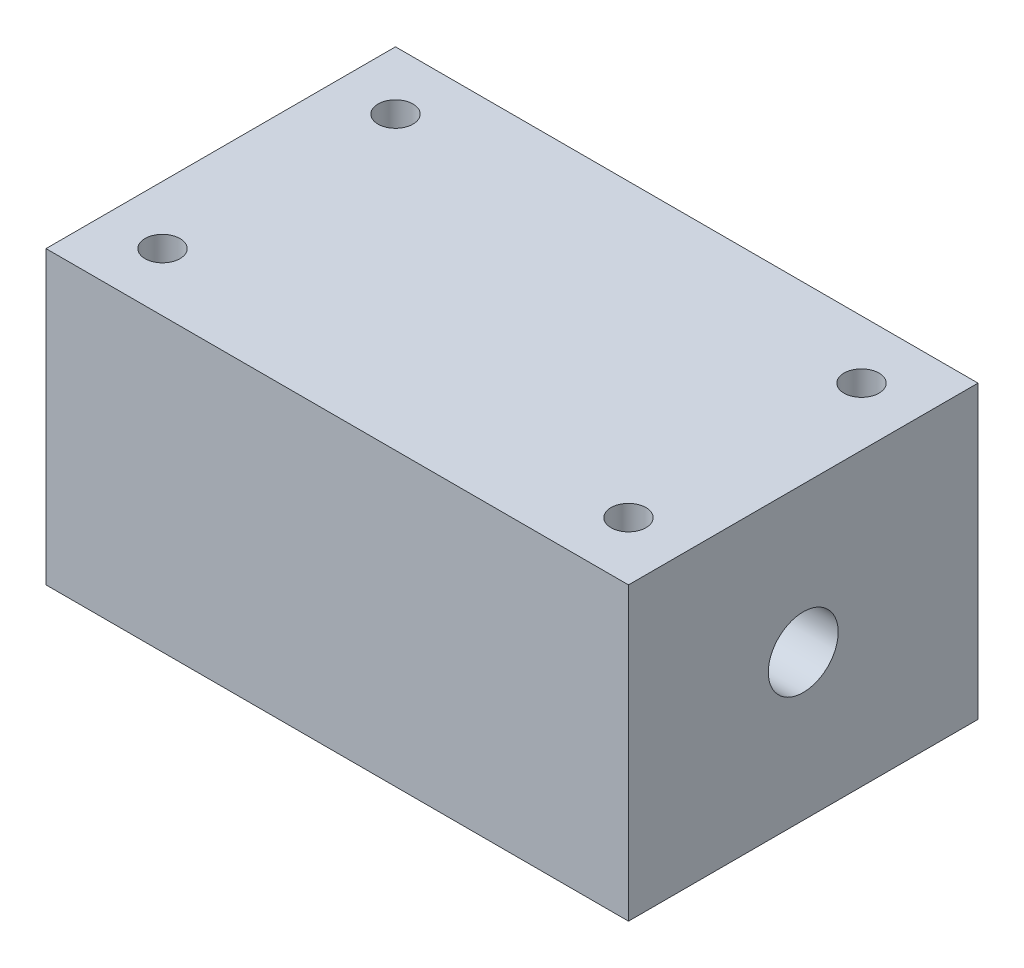
ISO-10303-21;
HEADER;
FILE_DESCRIPTION(('STEP AP214'),'2;1');
FILE_NAME('part.step','',(''),(''),'','','');
FILE_SCHEMA(('AUTOMOTIVE_DESIGN { 1 0 10303 214 1 1 1 1 }'));
ENDSEC;
DATA;
#1=APPLICATION_CONTEXT('core data for automotive mechanical design processes');
#2=APPLICATION_PROTOCOL_DEFINITION('international standard','automotive_design',2000,#1);
#3=PRODUCT_CONTEXT('',#1,'mechanical');
#4=PRODUCT('Part','Part','',(#3));
#5=PRODUCT_RELATED_PRODUCT_CATEGORY('part','',(#4));
#6=PRODUCT_DEFINITION_FORMATION('','',#4);
#7=PRODUCT_DEFINITION_CONTEXT('part definition',#1,'design');
#8=PRODUCT_DEFINITION('design','',#6,#7);
#9=PRODUCT_DEFINITION_SHAPE('','',#8);
#10=(LENGTH_UNIT() NAMED_UNIT(*) SI_UNIT(.MILLI.,.METRE.));
#11=(NAMED_UNIT(*) PLANE_ANGLE_UNIT() SI_UNIT($,.RADIAN.));
#12=(NAMED_UNIT(*) SI_UNIT($,.STERADIAN.) SOLID_ANGLE_UNIT());
#13=UNCERTAINTY_MEASURE_WITH_UNIT(LENGTH_MEASURE(1.E-05),#10,'distance_accuracy_value','');
#14=(GEOMETRIC_REPRESENTATION_CONTEXT(3) GLOBAL_UNCERTAINTY_ASSIGNED_CONTEXT((#13)) GLOBAL_UNIT_ASSIGNED_CONTEXT((#10,
#11,#12)) REPRESENTATION_CONTEXT('',''));
#15=CARTESIAN_POINT('',(0.,0.,0.));
#16=DIRECTION('',(0.,0.,1.));
#17=DIRECTION('',(1.,0.,0.));
#18=AXIS2_PLACEMENT_3D('',#15,#16,#17);
#19=CARTESIAN_POINT('',(25.,25.,-15.));
#20=DIRECTION('',(0.,-1.,0.));
#21=DIRECTION('',(0.,0.,-1.));
#22=AXIS2_PLACEMENT_3D('',#19,#20,#21);
#23=PLANE('',#22);
#24=CARTESIAN_POINT('',(20.,25.,9.99999999999997));
#25=DIRECTION('',(0.,1.,0.));
#26=DIRECTION('',(0.,0.,1.));
#27=AXIS2_PLACEMENT_3D('',#24,#25,#26);
#28=CIRCLE('',#27,1.5);
#29=CARTESIAN_POINT('',(20.,25.,11.5));
#30=VERTEX_POINT('',#29);
#31=EDGE_CURVE('E118',#30,#30,#28,.T.);
#32=ORIENTED_EDGE('',*,*,#31,.F.);
#33=EDGE_LOOP('',(#32));
#34=FACE_BOUND('',#33,.T.);
#35=CARTESIAN_POINT('',(-20.,25.,-9.99999999999999));
#36=DIRECTION('',(0.,1.,0.));
#37=DIRECTION('',(0.,0.,1.));
#38=AXIS2_PLACEMENT_3D('',#35,#36,#37);
#39=CIRCLE('',#38,1.5);
#40=CARTESIAN_POINT('',(-20.,25.,-8.49999999999999));
#41=VERTEX_POINT('',#40);
#42=EDGE_CURVE('E97',#41,#41,#39,.T.);
#43=ORIENTED_EDGE('',*,*,#42,.F.);
#44=EDGE_LOOP('',(#43));
#45=FACE_BOUND('',#44,.T.);
#46=DIRECTION('',(0.,0.,-1.));
#47=VECTOR('',#46,1.);
#48=CARTESIAN_POINT('',(25.,25.,15.));
#49=LINE('',#48,#47);
#50=CARTESIAN_POINT('',(25.,25.,15.));
#51=VERTEX_POINT('',#50);
#52=CARTESIAN_POINT('',(25.,25.,-15.));
#53=VERTEX_POINT('',#52);
#54=EDGE_CURVE('E82',#51,#53,#49,.T.);
#55=ORIENTED_EDGE('',*,*,#54,.T.);
#56=DIRECTION('',(-1.,0.,0.));
#57=VECTOR('',#56,1.);
#58=CARTESIAN_POINT('',(-25.,25.,-15.));
#59=LINE('',#58,#57);
#60=CARTESIAN_POINT('',(-25.,25.,-15.));
#61=VERTEX_POINT('',#60);
#62=EDGE_CURVE('E77',#53,#61,#59,.T.);
#63=ORIENTED_EDGE('',*,*,#62,.T.);
#64=DIRECTION('',(0.,0.,1.));
#65=VECTOR('',#64,1.);
#66=CARTESIAN_POINT('',(-25.,25.,15.));
#67=LINE('',#66,#65);
#68=CARTESIAN_POINT('',(-25.,25.,15.));
#69=VERTEX_POINT('',#68);
#70=EDGE_CURVE('E80',#61,#69,#67,.T.);
#71=ORIENTED_EDGE('',*,*,#70,.T.);
#72=DIRECTION('',(1.,0.,0.));
#73=VECTOR('',#72,1.);
#74=CARTESIAN_POINT('',(-25.,25.,15.));
#75=LINE('',#74,#73);
#76=EDGE_CURVE('E47',#69,#51,#75,.T.);
#77=ORIENTED_EDGE('',*,*,#76,.T.);
#78=EDGE_LOOP('',(#55,#63,#71,#77));
#79=FACE_BOUND('',#78,.T.);
#80=CARTESIAN_POINT('',(-20.,25.,9.99999999999997));
#81=DIRECTION('',(0.,1.,0.));
#82=DIRECTION('',(0.,0.,-1.));
#83=AXIS2_PLACEMENT_3D('',#80,#81,#82);
#84=CIRCLE('',#83,1.5);
#85=CARTESIAN_POINT('',(-20.,25.,8.49999999999997));
#86=VERTEX_POINT('',#85);
#87=EDGE_CURVE('E112',#86,#86,#84,.T.);
#88=ORIENTED_EDGE('',*,*,#87,.F.);
#89=EDGE_LOOP('',(#88));
#90=FACE_BOUND('',#89,.T.);
#91=CARTESIAN_POINT('',(20.,25.,-10.));
#92=DIRECTION('',(0.,1.,0.));
#93=DIRECTION('',(0.,0.,-1.));
#94=AXIS2_PLACEMENT_3D('',#91,#92,#93);
#95=CIRCLE('',#94,1.5);
#96=CARTESIAN_POINT('',(20.,25.,-11.5));
#97=VERTEX_POINT('',#96);
#98=EDGE_CURVE('E124',#97,#97,#95,.T.);
#99=ORIENTED_EDGE('',*,*,#98,.F.);
#100=EDGE_LOOP('',(#99));
#101=FACE_BOUND('',#100,.T.);
#102=ADVANCED_FACE('F30',(#34,#45,#79,#90,#101),#23,.F.);
#103=CARTESIAN_POINT('',(25.,0.,-15.));
#104=DIRECTION('',(0.,-1.,0.));
#105=DIRECTION('',(0.,0.,-1.));
#106=AXIS2_PLACEMENT_3D('',#103,#104,#105);
#107=PLANE('',#106);
#108=CARTESIAN_POINT('',(20.,0.,9.99999999999997));
#109=DIRECTION('',(0.,1.,0.));
#110=DIRECTION('',(0.,0.,1.));
#111=AXIS2_PLACEMENT_3D('',#108,#109,#110);
#112=CIRCLE('',#111,1.5);
#113=CARTESIAN_POINT('',(20.,0.,11.5));
#114=VERTEX_POINT('',#113);
#115=EDGE_CURVE('E121',#114,#114,#112,.T.);
#116=ORIENTED_EDGE('',*,*,#115,.T.);
#117=EDGE_LOOP('',(#116));
#118=FACE_BOUND('',#117,.T.);
#119=CARTESIAN_POINT('',(-20.,0.,-9.99999999999999));
#120=DIRECTION('',(0.,1.,0.));
#121=DIRECTION('',(0.,0.,1.));
#122=AXIS2_PLACEMENT_3D('',#119,#120,#121);
#123=CIRCLE('',#122,1.5);
#124=CARTESIAN_POINT('',(-20.,0.,-8.49999999999999));
#125=VERTEX_POINT('',#124);
#126=EDGE_CURVE('E109',#125,#125,#123,.T.);
#127=ORIENTED_EDGE('',*,*,#126,.T.);
#128=EDGE_LOOP('',(#127));
#129=FACE_BOUND('',#128,.T.);
#130=DIRECTION('',(0.,0.,-1.));
#131=VECTOR('',#130,1.);
#132=CARTESIAN_POINT('',(25.,0.,15.));
#133=LINE('',#132,#131);
#134=CARTESIAN_POINT('',(25.,0.,15.));
#135=VERTEX_POINT('',#134);
#136=CARTESIAN_POINT('',(25.,0.,-15.));
#137=VERTEX_POINT('',#136);
#138=EDGE_CURVE('E94',#135,#137,#133,.T.);
#139=ORIENTED_EDGE('',*,*,#138,.F.);
#140=DIRECTION('',(1.,0.,0.));
#141=VECTOR('',#140,1.);
#142=CARTESIAN_POINT('',(-25.,0.,15.));
#143=LINE('',#142,#141);
#144=CARTESIAN_POINT('',(-25.,0.,15.));
#145=VERTEX_POINT('',#144);
#146=EDGE_CURVE('E70',#145,#135,#143,.T.);
#147=ORIENTED_EDGE('',*,*,#146,.F.);
#148=DIRECTION('',(0.,0.,1.));
#149=VECTOR('',#148,1.);
#150=CARTESIAN_POINT('',(-25.,0.,15.));
#151=LINE('',#150,#149);
#152=CARTESIAN_POINT('',(-25.,0.,-15.));
#153=VERTEX_POINT('',#152);
#154=EDGE_CURVE('E64',#153,#145,#151,.T.);
#155=ORIENTED_EDGE('',*,*,#154,.F.);
#156=DIRECTION('',(-1.,0.,0.));
#157=VECTOR('',#156,1.);
#158=CARTESIAN_POINT('',(-25.,0.,-15.));
#159=LINE('',#158,#157);
#160=EDGE_CURVE('E86',#137,#153,#159,.T.);
#161=ORIENTED_EDGE('',*,*,#160,.F.);
#162=EDGE_LOOP('',(#139,#147,#155,#161));
#163=FACE_BOUND('',#162,.T.);
#164=CARTESIAN_POINT('',(-20.,0.,9.99999999999997));
#165=DIRECTION('',(0.,1.,0.));
#166=DIRECTION('',(0.,0.,-1.));
#167=AXIS2_PLACEMENT_3D('',#164,#165,#166);
#168=CIRCLE('',#167,1.5);
#169=CARTESIAN_POINT('',(-20.,0.,8.49999999999997));
#170=VERTEX_POINT('',#169);
#171=EDGE_CURVE('E115',#170,#170,#168,.T.);
#172=ORIENTED_EDGE('',*,*,#171,.T.);
#173=EDGE_LOOP('',(#172));
#174=FACE_BOUND('',#173,.T.);
#175=CARTESIAN_POINT('',(20.,0.,-10.));
#176=DIRECTION('',(0.,1.,0.));
#177=DIRECTION('',(0.,0.,-1.));
#178=AXIS2_PLACEMENT_3D('',#175,#176,#177);
#179=CIRCLE('',#178,1.5);
#180=CARTESIAN_POINT('',(20.,0.,-11.5));
#181=VERTEX_POINT('',#180);
#182=EDGE_CURVE('E127',#181,#181,#179,.T.);
#183=ORIENTED_EDGE('',*,*,#182,.T.);
#184=EDGE_LOOP('',(#183));
#185=FACE_BOUND('',#184,.T.);
#186=ADVANCED_FACE('F105',(#118,#129,#163,#174,#185),#107,.T.);
#187=CARTESIAN_POINT('',(25.,25.,15.));
#188=DIRECTION('',(-1.,0.,0.));
#189=DIRECTION('',(0.,0.,1.));
#190=AXIS2_PLACEMENT_3D('',#187,#188,#189);
#191=PLANE('',#190);
#192=CARTESIAN_POINT('',(25.,12.5,0.));
#193=DIRECTION('',(-1.,0.,0.));
#194=DIRECTION('',(0.,0.,1.));
#195=AXIS2_PLACEMENT_3D('',#192,#193,#194);
#196=CIRCLE('',#195,3.);
#197=CARTESIAN_POINT('',(25.,12.5,3.));
#198=VERTEX_POINT('',#197);
#199=EDGE_CURVE('E130',#198,#198,#196,.F.);
#200=ORIENTED_EDGE('',*,*,#199,.F.);
#201=EDGE_LOOP('',(#200));
#202=FACE_BOUND('',#201,.T.);
#203=ORIENTED_EDGE('',*,*,#138,.T.);
#204=DIRECTION('',(0.,-1.,0.));
#205=VECTOR('',#204,1.);
#206=CARTESIAN_POINT('',(25.,25.,-15.));
#207=LINE('',#206,#205);
#208=EDGE_CURVE('E11',#53,#137,#207,.T.);
#209=ORIENTED_EDGE('',*,*,#208,.F.);
#210=ORIENTED_EDGE('',*,*,#54,.F.);
#211=DIRECTION('',(0.,-1.,0.));
#212=VECTOR('',#211,1.);
#213=CARTESIAN_POINT('',(25.,25.,15.));
#214=LINE('',#213,#212);
#215=EDGE_CURVE('E90',#51,#135,#214,.T.);
#216=ORIENTED_EDGE('',*,*,#215,.T.);
#217=EDGE_LOOP('',(#203,#209,#210,#216));
#218=FACE_BOUND('',#217,.T.);
#219=ADVANCED_FACE('F32',(#202,#218),#191,.F.);
#220=CARTESIAN_POINT('',(-25.,25.,-15.));
#221=DIRECTION('',(0.,0.,1.));
#222=DIRECTION('',(1.,0.,0.));
#223=AXIS2_PLACEMENT_3D('',#220,#221,#222);
#224=PLANE('',#223);
#225=ORIENTED_EDGE('',*,*,#160,.T.);
#226=DIRECTION('',(0.,-1.,0.));
#227=VECTOR('',#226,1.);
#228=CARTESIAN_POINT('',(-25.,25.,-15.));
#229=LINE('',#228,#227);
#230=EDGE_CURVE('E39',#61,#153,#229,.T.);
#231=ORIENTED_EDGE('',*,*,#230,.F.);
#232=ORIENTED_EDGE('',*,*,#62,.F.);
#233=ORIENTED_EDGE('',*,*,#208,.T.);
#234=EDGE_LOOP('',(#225,#231,#232,#233));
#235=FACE_BOUND('',#234,.T.);
#236=ADVANCED_FACE('F85',(#235),#224,.F.);
#237=CARTESIAN_POINT('',(-25.,25.,15.));
#238=DIRECTION('',(1.,0.,0.));
#239=DIRECTION('',(0.,0.,-1.));
#240=AXIS2_PLACEMENT_3D('',#237,#238,#239);
#241=PLANE('',#240);
#242=CARTESIAN_POINT('',(-25.,12.5,0.));
#243=DIRECTION('',(-1.,0.,0.));
#244=DIRECTION('',(0.,0.,1.));
#245=AXIS2_PLACEMENT_3D('',#242,#243,#244);
#246=CIRCLE('',#245,3.);
#247=CARTESIAN_POINT('',(-25.,12.5,3.));
#248=VERTEX_POINT('',#247);
#249=EDGE_CURVE('E135',#248,#248,#246,.T.);
#250=ORIENTED_EDGE('',*,*,#249,.F.);
#251=EDGE_LOOP('',(#250));
#252=FACE_BOUND('',#251,.T.);
#253=ORIENTED_EDGE('',*,*,#154,.T.);
#254=DIRECTION('',(0.,-1.,0.));
#255=VECTOR('',#254,1.);
#256=CARTESIAN_POINT('',(-25.,25.,15.));
#257=LINE('',#256,#255);
#258=EDGE_CURVE('E87',#69,#145,#257,.T.);
#259=ORIENTED_EDGE('',*,*,#258,.F.);
#260=ORIENTED_EDGE('',*,*,#70,.F.);
#261=ORIENTED_EDGE('',*,*,#230,.T.);
#262=EDGE_LOOP('',(#253,#259,#260,#261));
#263=FACE_BOUND('',#262,.T.);
#264=ADVANCED_FACE('F88',(#252,#263),#241,.F.);
#265=CARTESIAN_POINT('',(-25.,25.,15.));
#266=DIRECTION('',(0.,0.,-1.));
#267=DIRECTION('',(-1.,0.,0.));
#268=AXIS2_PLACEMENT_3D('',#265,#266,#267);
#269=PLANE('',#268);
#270=ORIENTED_EDGE('',*,*,#146,.T.);
#271=ORIENTED_EDGE('',*,*,#215,.F.);
#272=ORIENTED_EDGE('',*,*,#76,.F.);
#273=ORIENTED_EDGE('',*,*,#258,.T.);
#274=EDGE_LOOP('',(#270,#271,#272,#273));
#275=FACE_BOUND('',#274,.T.);
#276=ADVANCED_FACE('F102',(#275),#269,.F.);
#277=CARTESIAN_POINT('',(-20.,25.,-9.99999999999999));
#278=DIRECTION('',(0.,-1.,0.));
#279=DIRECTION('',(0.,0.,-1.));
#280=AXIS2_PLACEMENT_3D('',#277,#278,#279);
#281=CYLINDRICAL_SURFACE('',#280,1.5);
#282=ORIENTED_EDGE('',*,*,#42,.T.);
#283=EDGE_LOOP('',(#282));
#284=FACE_BOUND('',#283,.T.);
#285=ORIENTED_EDGE('',*,*,#126,.F.);
#286=EDGE_LOOP('',(#285));
#287=FACE_BOUND('',#286,.T.);
#288=ADVANCED_FACE('F149',(#284,#287),#281,.F.);
#289=CARTESIAN_POINT('',(-20.,25.,9.99999999999997));
#290=DIRECTION('',(0.,-1.,0.));
#291=DIRECTION('',(0.,0.,-1.));
#292=AXIS2_PLACEMENT_3D('',#289,#290,#291);
#293=CYLINDRICAL_SURFACE('',#292,1.5);
#294=ORIENTED_EDGE('',*,*,#87,.T.);
#295=EDGE_LOOP('',(#294));
#296=FACE_BOUND('',#295,.T.);
#297=ORIENTED_EDGE('',*,*,#171,.F.);
#298=EDGE_LOOP('',(#297));
#299=FACE_BOUND('',#298,.T.);
#300=ADVANCED_FACE('F165',(#296,#299),#293,.F.);
#301=CARTESIAN_POINT('',(20.,25.,9.99999999999997));
#302=DIRECTION('',(0.,-1.,0.));
#303=DIRECTION('',(0.,0.,-1.));
#304=AXIS2_PLACEMENT_3D('',#301,#302,#303);
#305=CYLINDRICAL_SURFACE('',#304,1.5);
#306=ORIENTED_EDGE('',*,*,#31,.T.);
#307=EDGE_LOOP('',(#306));
#308=FACE_BOUND('',#307,.T.);
#309=ORIENTED_EDGE('',*,*,#115,.F.);
#310=EDGE_LOOP('',(#309));
#311=FACE_BOUND('',#310,.T.);
#312=ADVANCED_FACE('F169',(#308,#311),#305,.F.);
#313=CARTESIAN_POINT('',(20.,25.,-10.));
#314=DIRECTION('',(0.,-1.,0.));
#315=DIRECTION('',(0.,0.,-1.));
#316=AXIS2_PLACEMENT_3D('',#313,#314,#315);
#317=CYLINDRICAL_SURFACE('',#316,1.5);
#318=ORIENTED_EDGE('',*,*,#98,.T.);
#319=EDGE_LOOP('',(#318));
#320=FACE_BOUND('',#319,.T.);
#321=ORIENTED_EDGE('',*,*,#182,.F.);
#322=EDGE_LOOP('',(#321));
#323=FACE_BOUND('',#322,.T.);
#324=ADVANCED_FACE('F173',(#320,#323),#317,.F.);
#325=CARTESIAN_POINT('',(25.001,12.5,0.));
#326=DIRECTION('',(-1.,0.,0.));
#327=DIRECTION('',(0.,0.,1.));
#328=AXIS2_PLACEMENT_3D('',#325,#326,#327);
#329=CYLINDRICAL_SURFACE('',#328,3.);
#330=ORIENTED_EDGE('',*,*,#249,.T.);
#331=EDGE_LOOP('',(#330));
#332=FACE_BOUND('',#331,.T.);
#333=ORIENTED_EDGE('',*,*,#199,.T.);
#334=EDGE_LOOP('',(#333));
#335=FACE_BOUND('',#334,.T.);
#336=ADVANCED_FACE('F139',(#332,#335),#329,.F.);
#337=CLOSED_SHELL('',(#102,#186,#219,#236,#264,#276,#288,#300,#312,#324,#336));
#338=MANIFOLD_SOLID_BREP('B2',#337);
#339=ADVANCED_BREP_SHAPE_REPRESENTATION('',(#18,#338),#14);
#340=SHAPE_DEFINITION_REPRESENTATION(#9,#339);
ENDSEC;
END-ISO-10303-21;
